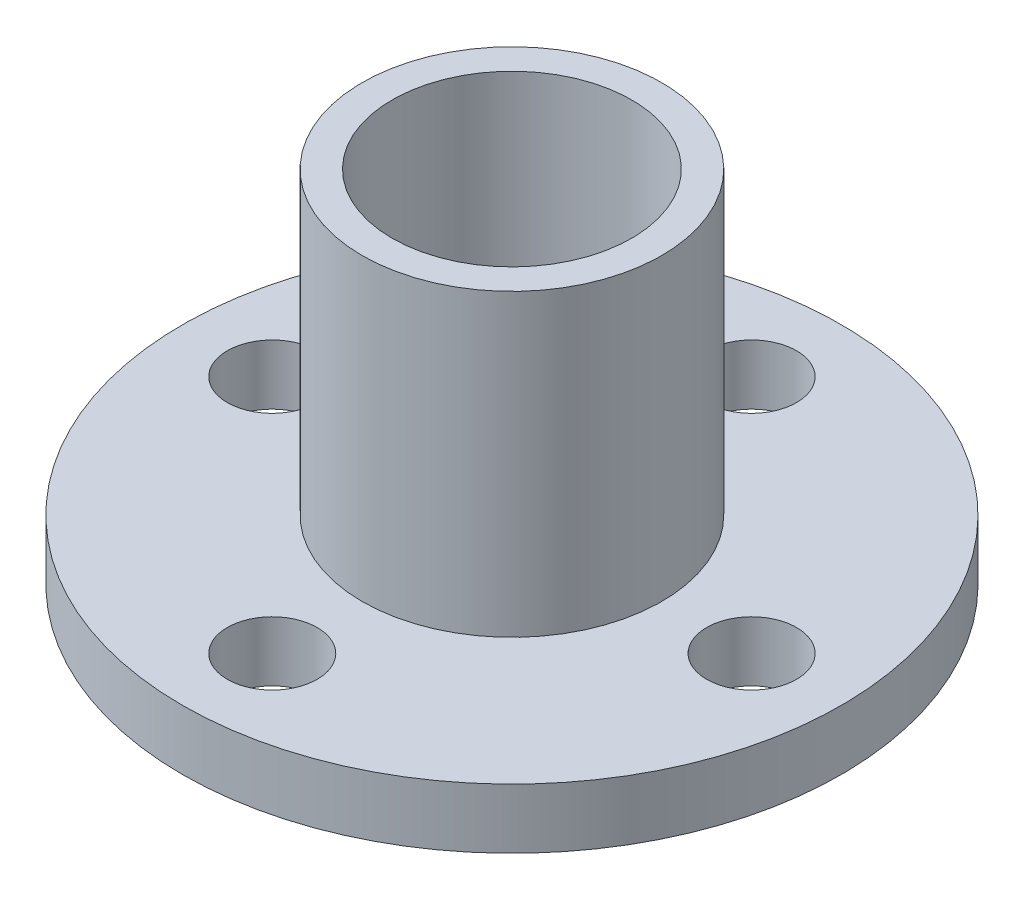
ISO-10303-21;
HEADER;
FILE_DESCRIPTION(('STEP AP214'),'2;1');
FILE_NAME('part.step','',(''),(''),'','','');
FILE_SCHEMA(('AUTOMOTIVE_DESIGN { 1 0 10303 214 1 1 1 1 }'));
ENDSEC;
DATA;
#1=APPLICATION_CONTEXT('core data for automotive mechanical design processes');
#2=APPLICATION_PROTOCOL_DEFINITION('international standard','automotive_design',2000,#1);
#3=PRODUCT_CONTEXT('',#1,'mechanical');
#4=PRODUCT('Part','Part','',(#3));
#5=PRODUCT_RELATED_PRODUCT_CATEGORY('part','',(#4));
#6=PRODUCT_DEFINITION_FORMATION('','',#4);
#7=PRODUCT_DEFINITION_CONTEXT('part definition',#1,'design');
#8=PRODUCT_DEFINITION('design','',#6,#7);
#9=PRODUCT_DEFINITION_SHAPE('','',#8);
#10=(LENGTH_UNIT() NAMED_UNIT(*) SI_UNIT(.MILLI.,.METRE.));
#11=(NAMED_UNIT(*) PLANE_ANGLE_UNIT() SI_UNIT($,.RADIAN.));
#12=(NAMED_UNIT(*) SI_UNIT($,.STERADIAN.) SOLID_ANGLE_UNIT());
#13=UNCERTAINTY_MEASURE_WITH_UNIT(LENGTH_MEASURE(1.E-05),#10,'distance_accuracy_value','');
#14=(GEOMETRIC_REPRESENTATION_CONTEXT(3) GLOBAL_UNCERTAINTY_ASSIGNED_CONTEXT((#13)) GLOBAL_UNIT_ASSIGNED_CONTEXT((#10,
#11,#12)) REPRESENTATION_CONTEXT('',''));
#15=CARTESIAN_POINT('',(0.,0.,0.));
#16=DIRECTION('',(0.,0.,1.));
#17=DIRECTION('',(1.,0.,0.));
#18=AXIS2_PLACEMENT_3D('',#15,#16,#17);
#19=CARTESIAN_POINT('',(0.,2.,-8.));
#20=DIRECTION('',(0.,-1.,0.));
#21=DIRECTION('',(0.,0.,-1.));
#22=AXIS2_PLACEMENT_3D('',#19,#20,#21);
#23=CYLINDRICAL_SURFACE('',#22,1.5);
#24=CARTESIAN_POINT('',(0.,2.,-8.));
#25=DIRECTION('',(0.,1.,0.));
#26=DIRECTION('',(0.,0.,1.));
#27=AXIS2_PLACEMENT_3D('',#24,#25,#26);
#28=CIRCLE('',#27,1.5);
#29=CARTESIAN_POINT('',(0.,2.,-6.5));
#30=VERTEX_POINT('',#29);
#31=EDGE_CURVE('E51',#30,#30,#28,.T.);
#32=ORIENTED_EDGE('',*,*,#31,.T.);
#33=EDGE_LOOP('',(#32));
#34=FACE_BOUND('',#33,.T.);
#35=CARTESIAN_POINT('',(0.,0.,-8.));
#36=DIRECTION('',(0.,1.,0.));
#37=DIRECTION('',(0.,0.,1.));
#38=AXIS2_PLACEMENT_3D('',#35,#36,#37);
#39=CIRCLE('',#38,1.5);
#40=CARTESIAN_POINT('',(0.,0.,-6.5));
#41=VERTEX_POINT('',#40);
#42=EDGE_CURVE('E64',#41,#41,#39,.T.);
#43=ORIENTED_EDGE('',*,*,#42,.F.);
#44=EDGE_LOOP('',(#43));
#45=FACE_BOUND('',#44,.T.);
#46=ADVANCED_FACE('F38',(#34,#45),#23,.F.);
#47=CARTESIAN_POINT('',(8.,2.,0.));
#48=DIRECTION('',(0.,-1.,0.));
#49=DIRECTION('',(0.,0.,-1.));
#50=AXIS2_PLACEMENT_3D('',#47,#48,#49);
#51=CYLINDRICAL_SURFACE('',#50,1.5);
#52=CARTESIAN_POINT('',(8.,2.,0.));
#53=DIRECTION('',(0.,1.,0.));
#54=DIRECTION('',(0.,0.,1.));
#55=AXIS2_PLACEMENT_3D('',#52,#53,#54);
#56=CIRCLE('',#55,1.5);
#57=CARTESIAN_POINT('',(8.,2.,1.50000000000003));
#58=VERTEX_POINT('',#57);
#59=EDGE_CURVE('E78',#58,#58,#56,.T.);
#60=ORIENTED_EDGE('',*,*,#59,.T.);
#61=EDGE_LOOP('',(#60));
#62=FACE_BOUND('',#61,.T.);
#63=CARTESIAN_POINT('',(8.,0.,0.));
#64=DIRECTION('',(0.,1.,0.));
#65=DIRECTION('',(0.,0.,1.));
#66=AXIS2_PLACEMENT_3D('',#63,#64,#65);
#67=CIRCLE('',#66,1.5);
#68=CARTESIAN_POINT('',(8.,0.,1.50000000000003));
#69=VERTEX_POINT('',#68);
#70=EDGE_CURVE('E62',#69,#69,#67,.T.);
#71=ORIENTED_EDGE('',*,*,#70,.F.);
#72=EDGE_LOOP('',(#71));
#73=FACE_BOUND('',#72,.T.);
#74=ADVANCED_FACE('F125',(#62,#73),#51,.F.);
#75=CARTESIAN_POINT('',(0.,2.,8.));
#76=DIRECTION('',(0.,-1.,0.));
#77=DIRECTION('',(0.,0.,-1.));
#78=AXIS2_PLACEMENT_3D('',#75,#76,#77);
#79=CYLINDRICAL_SURFACE('',#78,1.5);
#80=CARTESIAN_POINT('',(0.,2.,8.));
#81=DIRECTION('',(0.,1.,0.));
#82=DIRECTION('',(0.,0.,1.));
#83=AXIS2_PLACEMENT_3D('',#80,#81,#82);
#84=CIRCLE('',#83,1.5);
#85=CARTESIAN_POINT('',(0.,2.,9.5));
#86=VERTEX_POINT('',#85);
#87=EDGE_CURVE('E73',#86,#86,#84,.T.);
#88=ORIENTED_EDGE('',*,*,#87,.T.);
#89=EDGE_LOOP('',(#88));
#90=FACE_BOUND('',#89,.T.);
#91=CARTESIAN_POINT('',(0.,0.,8.));
#92=DIRECTION('',(0.,1.,0.));
#93=DIRECTION('',(0.,0.,1.));
#94=AXIS2_PLACEMENT_3D('',#91,#92,#93);
#95=CIRCLE('',#94,1.5);
#96=CARTESIAN_POINT('',(0.,0.,9.5));
#97=VERTEX_POINT('',#96);
#98=EDGE_CURVE('E58',#97,#97,#95,.T.);
#99=ORIENTED_EDGE('',*,*,#98,.F.);
#100=EDGE_LOOP('',(#99));
#101=FACE_BOUND('',#100,.T.);
#102=ADVANCED_FACE('F130',(#90,#101),#79,.F.);
#103=CARTESIAN_POINT('',(-8.,2.,0.));
#104=DIRECTION('',(0.,-1.,0.));
#105=DIRECTION('',(0.,0.,-1.));
#106=AXIS2_PLACEMENT_3D('',#103,#104,#105);
#107=CYLINDRICAL_SURFACE('',#106,1.5);
#108=CARTESIAN_POINT('',(-8.,2.,0.));
#109=DIRECTION('',(0.,1.,0.));
#110=DIRECTION('',(0.,0.,1.));
#111=AXIS2_PLACEMENT_3D('',#108,#109,#110);
#112=CIRCLE('',#111,1.5);
#113=CARTESIAN_POINT('',(-8.,2.,1.49999999999992));
#114=VERTEX_POINT('',#113);
#115=EDGE_CURVE('E69',#114,#114,#112,.T.);
#116=ORIENTED_EDGE('',*,*,#115,.T.);
#117=EDGE_LOOP('',(#116));
#118=FACE_BOUND('',#117,.T.);
#119=CARTESIAN_POINT('',(-8.,0.,0.));
#120=DIRECTION('',(0.,1.,0.));
#121=DIRECTION('',(0.,0.,1.));
#122=AXIS2_PLACEMENT_3D('',#119,#120,#121);
#123=CIRCLE('',#122,1.5);
#124=CARTESIAN_POINT('',(-8.,0.,1.49999999999992));
#125=VERTEX_POINT('',#124);
#126=EDGE_CURVE('E55',#125,#125,#123,.T.);
#127=ORIENTED_EDGE('',*,*,#126,.F.);
#128=EDGE_LOOP('',(#127));
#129=FACE_BOUND('',#128,.T.);
#130=ADVANCED_FACE('F40',(#118,#129),#107,.F.);
#131=CARTESIAN_POINT('',(0.,2.,0.));
#132=DIRECTION('',(0.,-1.,0.));
#133=DIRECTION('',(0.,0.,-1.));
#134=AXIS2_PLACEMENT_3D('',#131,#132,#133);
#135=CYLINDRICAL_SURFACE('',#134,11.);
#136=CARTESIAN_POINT('',(0.,2.,0.));
#137=DIRECTION('',(0.,1.,0.));
#138=DIRECTION('',(0.,0.,1.));
#139=AXIS2_PLACEMENT_3D('',#136,#137,#138);
#140=CIRCLE('',#139,11.);
#141=CARTESIAN_POINT('',(0.,2.,11.));
#142=VERTEX_POINT('',#141);
#143=EDGE_CURVE('E10',#142,#142,#140,.T.);
#144=ORIENTED_EDGE('',*,*,#143,.F.);
#145=EDGE_LOOP('',(#144));
#146=FACE_BOUND('',#145,.T.);
#147=CARTESIAN_POINT('',(0.,0.,0.));
#148=DIRECTION('',(0.,1.,0.));
#149=DIRECTION('',(0.,0.,1.));
#150=AXIS2_PLACEMENT_3D('',#147,#148,#149);
#151=CIRCLE('',#150,11.);
#152=CARTESIAN_POINT('',(0.,0.,11.));
#153=VERTEX_POINT('',#152);
#154=EDGE_CURVE('E42',#153,#153,#151,.T.);
#155=ORIENTED_EDGE('',*,*,#154,.T.);
#156=EDGE_LOOP('',(#155));
#157=FACE_BOUND('',#156,.T.);
#158=ADVANCED_FACE('F94',(#146,#157),#135,.T.);
#159=CARTESIAN_POINT('',(0.,2.,0.));
#160=DIRECTION('',(0.,1.,0.));
#161=DIRECTION('',(0.,0.,1.));
#162=AXIS2_PLACEMENT_3D('',#159,#160,#161);
#163=PLANE('',#162);
#164=ORIENTED_EDGE('',*,*,#115,.F.);
#165=EDGE_LOOP('',(#164));
#166=FACE_BOUND('',#165,.T.);
#167=ORIENTED_EDGE('',*,*,#87,.F.);
#168=EDGE_LOOP('',(#167));
#169=FACE_BOUND('',#168,.T.);
#170=ORIENTED_EDGE('',*,*,#59,.F.);
#171=EDGE_LOOP('',(#170));
#172=FACE_BOUND('',#171,.T.);
#173=ORIENTED_EDGE('',*,*,#31,.F.);
#174=EDGE_LOOP('',(#173));
#175=FACE_BOUND('',#174,.T.);
#176=CARTESIAN_POINT('',(0.,2.,0.));
#177=DIRECTION('',(0.,1.,0.));
#178=DIRECTION('',(0.,0.,1.));
#179=AXIS2_PLACEMENT_3D('',#176,#177,#178);
#180=CIRCLE('',#179,5.);
#181=CARTESIAN_POINT('',(0.,2.,5.));
#182=VERTEX_POINT('',#181);
#183=EDGE_CURVE('E46',#182,#182,#180,.T.);
#184=ORIENTED_EDGE('',*,*,#183,.F.);
#185=EDGE_LOOP('',(#184));
#186=FACE_BOUND('',#185,.T.);
#187=ORIENTED_EDGE('',*,*,#143,.T.);
#188=EDGE_LOOP('',(#187));
#189=FACE_BOUND('',#188,.T.);
#190=ADVANCED_FACE('F90',(#166,#169,#172,#175,#186,#189),#163,.T.);
#191=CARTESIAN_POINT('',(0.,0.,0.));
#192=DIRECTION('',(0.,1.,0.));
#193=DIRECTION('',(0.,0.,1.));
#194=AXIS2_PLACEMENT_3D('',#191,#192,#193);
#195=PLANE('',#194);
#196=ORIENTED_EDGE('',*,*,#126,.T.);
#197=EDGE_LOOP('',(#196));
#198=FACE_BOUND('',#197,.T.);
#199=ORIENTED_EDGE('',*,*,#98,.T.);
#200=EDGE_LOOP('',(#199));
#201=FACE_BOUND('',#200,.T.);
#202=ORIENTED_EDGE('',*,*,#70,.T.);
#203=EDGE_LOOP('',(#202));
#204=FACE_BOUND('',#203,.T.);
#205=ORIENTED_EDGE('',*,*,#42,.T.);
#206=EDGE_LOOP('',(#205));
#207=FACE_BOUND('',#206,.T.);
#208=ORIENTED_EDGE('',*,*,#154,.F.);
#209=EDGE_LOOP('',(#208));
#210=FACE_BOUND('',#209,.T.);
#211=CARTESIAN_POINT('',(0.,0.,0.));
#212=DIRECTION('',(0.,1.,0.));
#213=DIRECTION('',(0.,0.,1.));
#214=AXIS2_PLACEMENT_3D('',#211,#212,#213);
#215=CIRCLE('',#214,4.);
#216=CARTESIAN_POINT('',(0.,0.,4.));
#217=VERTEX_POINT('',#216);
#218=EDGE_CURVE('E81',#217,#217,#215,.T.);
#219=ORIENTED_EDGE('',*,*,#218,.T.);
#220=EDGE_LOOP('',(#219));
#221=FACE_BOUND('',#220,.T.);
#222=ADVANCED_FACE('F93',(#198,#201,#204,#207,#210,#221),#195,.F.);
#223=CARTESIAN_POINT('',(0.,12.,0.));
#224=DIRECTION('',(0.,-1.,0.));
#225=DIRECTION('',(0.,0.,-1.));
#226=AXIS2_PLACEMENT_3D('',#223,#224,#225);
#227=CYLINDRICAL_SURFACE('',#226,4.);
#228=CARTESIAN_POINT('',(0.,12.,0.));
#229=DIRECTION('',(0.,1.,0.));
#230=DIRECTION('',(0.,0.,1.));
#231=AXIS2_PLACEMENT_3D('',#228,#229,#230);
#232=CIRCLE('',#231,4.);
#233=CARTESIAN_POINT('',(0.,12.,4.));
#234=VERTEX_POINT('',#233);
#235=EDGE_CURVE('E108',#234,#234,#232,.T.);
#236=ORIENTED_EDGE('',*,*,#235,.T.);
#237=EDGE_LOOP('',(#236));
#238=FACE_BOUND('',#237,.T.);
#239=ORIENTED_EDGE('',*,*,#218,.F.);
#240=EDGE_LOOP('',(#239));
#241=FACE_BOUND('',#240,.T.);
#242=ADVANCED_FACE('F103',(#238,#241),#227,.F.);
#243=CARTESIAN_POINT('',(0.,12.,0.));
#244=DIRECTION('',(0.,-1.,0.));
#245=DIRECTION('',(0.,0.,-1.));
#246=AXIS2_PLACEMENT_3D('',#243,#244,#245);
#247=CYLINDRICAL_SURFACE('',#246,5.);
#248=ORIENTED_EDGE('',*,*,#183,.T.);
#249=EDGE_LOOP('',(#248));
#250=FACE_BOUND('',#249,.T.);
#251=CARTESIAN_POINT('',(0.,12.,0.));
#252=DIRECTION('',(0.,1.,0.));
#253=DIRECTION('',(0.,0.,1.));
#254=AXIS2_PLACEMENT_3D('',#251,#252,#253);
#255=CIRCLE('',#254,5.);
#256=CARTESIAN_POINT('',(0.,12.,5.));
#257=VERTEX_POINT('',#256);
#258=EDGE_CURVE('E59',#257,#257,#255,.T.);
#259=ORIENTED_EDGE('',*,*,#258,.F.);
#260=EDGE_LOOP('',(#259));
#261=FACE_BOUND('',#260,.T.);
#262=ADVANCED_FACE('F99',(#250,#261),#247,.T.);
#263=CARTESIAN_POINT('',(0.,12.,0.));
#264=DIRECTION('',(0.,1.,0.));
#265=DIRECTION('',(0.,0.,1.));
#266=AXIS2_PLACEMENT_3D('',#263,#264,#265);
#267=PLANE('',#266);
#268=ORIENTED_EDGE('',*,*,#235,.F.);
#269=EDGE_LOOP('',(#268));
#270=FACE_BOUND('',#269,.T.);
#271=ORIENTED_EDGE('',*,*,#258,.T.);
#272=EDGE_LOOP('',(#271));
#273=FACE_BOUND('',#272,.T.);
#274=ADVANCED_FACE('F102',(#270,#273),#267,.T.);
#275=CLOSED_SHELL('',(#46,#74,#102,#130,#158,#190,#222,#242,#262,#274));
#276=MANIFOLD_SOLID_BREP('B2',#275);
#277=ADVANCED_BREP_SHAPE_REPRESENTATION('',(#18,#276),#14);
#278=SHAPE_DEFINITION_REPRESENTATION(#9,#277);
ENDSEC;
END-ISO-10303-21;
